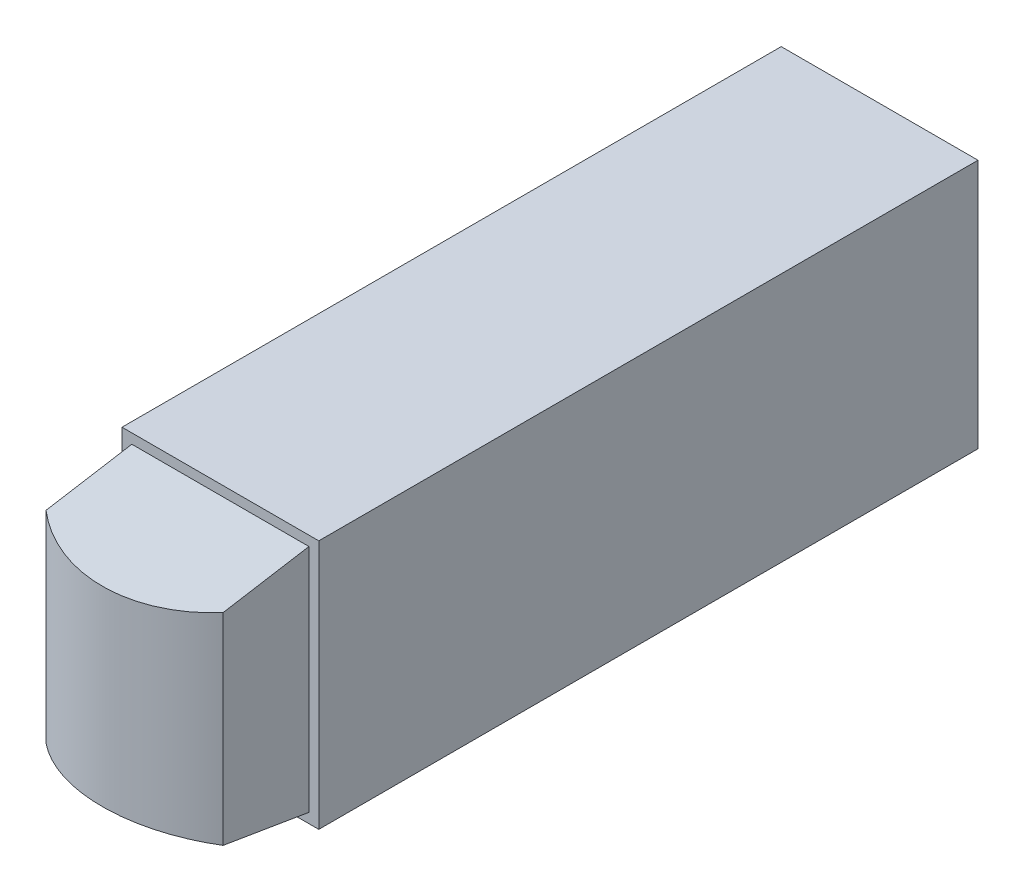
ISO-10303-21;
HEADER;
FILE_DESCRIPTION(('STEP AP214'),'2;1');
FILE_NAME('part.step','',(''),(''),'','','');
FILE_SCHEMA(('AUTOMOTIVE_DESIGN { 1 0 10303 214 1 1 1 1 }'));
ENDSEC;
DATA;
#1=APPLICATION_CONTEXT('core data for automotive mechanical design processes');
#2=APPLICATION_PROTOCOL_DEFINITION('international standard','automotive_design',2000,#1);
#3=PRODUCT_CONTEXT('',#1,'mechanical');
#4=PRODUCT('Part','Part','',(#3));
#5=PRODUCT_RELATED_PRODUCT_CATEGORY('part','',(#4));
#6=PRODUCT_DEFINITION_FORMATION('','',#4);
#7=PRODUCT_DEFINITION_CONTEXT('part definition',#1,'design');
#8=PRODUCT_DEFINITION('design','',#6,#7);
#9=PRODUCT_DEFINITION_SHAPE('','',#8);
#10=(LENGTH_UNIT() NAMED_UNIT(*) SI_UNIT(.MILLI.,.METRE.));
#11=(NAMED_UNIT(*) PLANE_ANGLE_UNIT() SI_UNIT($,.RADIAN.));
#12=(NAMED_UNIT(*) SI_UNIT($,.STERADIAN.) SOLID_ANGLE_UNIT());
#13=UNCERTAINTY_MEASURE_WITH_UNIT(LENGTH_MEASURE(1.E-05),#10,'distance_accuracy_value','');
#14=(GEOMETRIC_REPRESENTATION_CONTEXT(3) GLOBAL_UNCERTAINTY_ASSIGNED_CONTEXT((#13)) GLOBAL_UNIT_ASSIGNED_CONTEXT((#10,
#11,#12)) REPRESENTATION_CONTEXT('',''));
#15=CARTESIAN_POINT('',(0.,0.,0.));
#16=DIRECTION('',(0.,0.,1.));
#17=DIRECTION('',(1.,0.,0.));
#18=AXIS2_PLACEMENT_3D('',#15,#16,#17);
#19=CARTESIAN_POINT('',(0.,-0.635,3.25));
#20=DIRECTION('',(0.,-1.,0.));
#21=DIRECTION('',(0.,0.,-1.));
#22=AXIS2_PLACEMENT_3D('',#19,#20,#21);
#23=CYLINDRICAL_SURFACE('',#22,0.7);
#24=CARTESIAN_POINT('',(0.,-0.601666666666666,3.25));
#25=DIRECTION('',(0.,0.986393923832144,-0.164398987305357));
#26=DIRECTION('',(0.,-0.164398987305357,-0.986393923832144));
#27=AXIS2_PLACEMENT_3D('',#24,#25,#26);
#28=ELLIPSE('',#27,0.709655628534792,0.7);
#29=CARTESIAN_POINT('',(-0.45,-0.512301622543637,3.78619026473818));
#30=VERTEX_POINT('',#29);
#31=CARTESIAN_POINT('',(0.45,-0.512301622543637,3.78619026473818));
#32=VERTEX_POINT('',#31);
#33=EDGE_CURVE('E19',#30,#32,#28,.T.);
#34=ORIENTED_EDGE('',*,*,#33,.T.);
#35=DIRECTION('',(0.,1.,0.));
#36=VECTOR('',#35,1.);
#37=CARTESIAN_POINT('',(0.45,-0.635,3.78619026473818));
#38=LINE('',#37,#36);
#39=CARTESIAN_POINT('',(0.45,0.512301622543636,3.78619026473818));
#40=VERTEX_POINT('',#39);
#41=EDGE_CURVE('E81',#32,#40,#38,.T.);
#42=ORIENTED_EDGE('',*,*,#41,.T.);
#43=CARTESIAN_POINT('',(0.,0.601666666666667,3.25));
#44=DIRECTION('',(0.,0.986393923832144,0.164398987305358));
#45=DIRECTION('',(0.,-0.164398987305358,0.986393923832144));
#46=AXIS2_PLACEMENT_3D('',#43,#44,#45);
#47=ELLIPSE('',#46,0.709655628534792,0.7);
#48=CARTESIAN_POINT('',(-0.45,0.512301622543636,3.78619026473818));
#49=VERTEX_POINT('',#48);
#50=EDGE_CURVE('E110',#49,#40,#47,.T.);
#51=ORIENTED_EDGE('',*,*,#50,.F.);
#52=DIRECTION('',(0.,1.,0.));
#53=VECTOR('',#52,1.);
#54=CARTESIAN_POINT('',(-0.45,-0.635,3.78619026473818));
#55=LINE('',#54,#53);
#56=EDGE_CURVE('E78',#49,#30,#55,.F.);
#57=ORIENTED_EDGE('',*,*,#56,.T.);
#58=EDGE_LOOP('',(#34,#42,#51,#57));
#59=FACE_BOUND('',#58,.T.);
#60=ADVANCED_FACE('F16',(#59),#23,.T.);
#61=CARTESIAN_POINT('',(-0.45,-0.635,3.78619026473818));
#62=DIRECTION('',(1.,0.,0.));
#63=DIRECTION('',(0.,0.,-1.));
#64=AXIS2_PLACEMENT_3D('',#61,#62,#63);
#65=PLANE('',#64);
#66=DIRECTION('',(0.,1.,0.));
#67=VECTOR('',#66,1.);
#68=CARTESIAN_POINT('',(-0.45,-0.635,3.35));
#69=LINE('',#68,#67);
#70=CARTESIAN_POINT('',(-0.45,0.585,3.35));
#71=VERTEX_POINT('',#70);
#72=CARTESIAN_POINT('',(-0.45,-0.585,3.35));
#73=VERTEX_POINT('',#72);
#74=EDGE_CURVE('E108',#71,#73,#69,.F.);
#75=ORIENTED_EDGE('',*,*,#74,.T.);
#76=DIRECTION('',(0.,0.164398987305357,0.986393923832144));
#77=VECTOR('',#76,1.);
#78=CARTESIAN_POINT('',(-0.45,-0.485,3.95));
#79=LINE('',#78,#77);
#80=EDGE_CURVE('E87',#73,#30,#79,.T.);
#81=ORIENTED_EDGE('',*,*,#80,.T.);
#82=ORIENTED_EDGE('',*,*,#56,.F.);
#83=DIRECTION('',(0.,-0.164398987305358,0.986393923832144));
#84=VECTOR('',#83,1.);
#85=CARTESIAN_POINT('',(-0.45,0.585,3.35));
#86=LINE('',#85,#84);
#87=EDGE_CURVE('E112',#71,#49,#86,.T.);
#88=ORIENTED_EDGE('',*,*,#87,.F.);
#89=EDGE_LOOP('',(#75,#81,#82,#88));
#90=FACE_BOUND('',#89,.T.);
#91=ADVANCED_FACE('F246',(#90),#65,.F.);
#92=CARTESIAN_POINT('',(3.76795032773344,-0.485,3.95));
#93=DIRECTION('',(0.,0.986393923832144,-0.164398987305357));
#94=DIRECTION('',(0.,0.164398987305357,0.986393923832144));
#95=AXIS2_PLACEMENT_3D('',#92,#93,#94);
#96=PLANE('',#95);
#97=ORIENTED_EDGE('',*,*,#80,.F.);
#98=DIRECTION('',(-1.,0.,0.));
#99=VECTOR('',#98,1.);
#100=CARTESIAN_POINT('',(-0.45,-0.585,3.35));
#101=LINE('',#100,#99);
#102=CARTESIAN_POINT('',(0.45,-0.585,3.35));
#103=VERTEX_POINT('',#102);
#104=EDGE_CURVE('E98',#73,#103,#101,.F.);
#105=ORIENTED_EDGE('',*,*,#104,.T.);
#106=DIRECTION('',(0.,0.164398987305357,0.986393923832144));
#107=VECTOR('',#106,1.);
#108=CARTESIAN_POINT('',(0.45,-0.585,3.35));
#109=LINE('',#108,#107);
#110=EDGE_CURVE('E86',#103,#32,#109,.T.);
#111=ORIENTED_EDGE('',*,*,#110,.T.);
#112=ORIENTED_EDGE('',*,*,#33,.F.);
#113=EDGE_LOOP('',(#97,#105,#111,#112));
#114=FACE_BOUND('',#113,.T.);
#115=ADVANCED_FACE('F96',(#114),#96,.F.);
#116=CARTESIAN_POINT('',(0.45,-0.635,3.35));
#117=DIRECTION('',(-1.,0.,0.));
#118=DIRECTION('',(0.,0.,1.));
#119=AXIS2_PLACEMENT_3D('',#116,#117,#118);
#120=PLANE('',#119);
#121=ORIENTED_EDGE('',*,*,#41,.F.);
#122=ORIENTED_EDGE('',*,*,#110,.F.);
#123=DIRECTION('',(0.,1.,0.));
#124=VECTOR('',#123,1.);
#125=CARTESIAN_POINT('',(0.45,-0.635,3.35));
#126=LINE('',#125,#124);
#127=CARTESIAN_POINT('',(0.45,0.585,3.35));
#128=VERTEX_POINT('',#127);
#129=EDGE_CURVE('E107',#103,#128,#126,.T.);
#130=ORIENTED_EDGE('',*,*,#129,.T.);
#131=DIRECTION('',(0.,-0.164398987305358,0.986393923832144));
#132=VECTOR('',#131,1.);
#133=CARTESIAN_POINT('',(0.45,0.585,3.35));
#134=LINE('',#133,#132);
#135=EDGE_CURVE('E93',#40,#128,#134,.F.);
#136=ORIENTED_EDGE('',*,*,#135,.F.);
#137=EDGE_LOOP('',(#121,#122,#130,#136));
#138=FACE_BOUND('',#137,.T.);
#139=ADVANCED_FACE('F90',(#138),#120,.F.);
#140=CARTESIAN_POINT('',(3.76795032773344,0.585,3.35));
#141=DIRECTION('',(0.,0.986393923832144,0.164398987305358));
#142=DIRECTION('',(0.,-0.164398987305358,0.986393923832144));
#143=AXIS2_PLACEMENT_3D('',#140,#141,#142);
#144=PLANE('',#143);
#145=ORIENTED_EDGE('',*,*,#87,.T.);
#146=ORIENTED_EDGE('',*,*,#50,.T.);
#147=ORIENTED_EDGE('',*,*,#135,.T.);
#148=DIRECTION('',(-1.,0.,0.));
#149=VECTOR('',#148,1.);
#150=CARTESIAN_POINT('',(-0.45,0.585,3.35));
#151=LINE('',#150,#149);
#152=EDGE_CURVE('E134',#128,#71,#151,.T.);
#153=ORIENTED_EDGE('',*,*,#152,.T.);
#154=EDGE_LOOP('',(#145,#146,#147,#153));
#155=FACE_BOUND('',#154,.T.);
#156=ADVANCED_FACE('F142',(#155),#144,.T.);
#157=CARTESIAN_POINT('',(0.5,-0.635,0.));
#158=DIRECTION('',(-1.,0.,0.));
#159=DIRECTION('',(0.,0.,1.));
#160=AXIS2_PLACEMENT_3D('',#157,#158,#159);
#161=PLANE('',#160);
#162=DIRECTION('',(0.,1.,0.));
#163=VECTOR('',#162,1.);
#164=CARTESIAN_POINT('',(0.5,-0.635,3.35));
#165=LINE('',#164,#163);
#166=CARTESIAN_POINT('',(0.5,0.635,3.35));
#167=VERTEX_POINT('',#166);
#168=CARTESIAN_POINT('',(0.5,-0.635,3.35));
#169=VERTEX_POINT('',#168);
#170=EDGE_CURVE('E111',#167,#169,#165,.F.);
#171=ORIENTED_EDGE('',*,*,#170,.T.);
#172=DIRECTION('',(0.,0.,-1.));
#173=VECTOR('',#172,1.);
#174=CARTESIAN_POINT('',(0.5,-0.635,3.25));
#175=LINE('',#174,#173);
#176=CARTESIAN_POINT('',(0.5,-0.635,0.));
#177=VERTEX_POINT('',#176);
#178=EDGE_CURVE('E278',#177,#169,#175,.F.);
#179=ORIENTED_EDGE('',*,*,#178,.F.);
#180=DIRECTION('',(0.,1.,0.));
#181=VECTOR('',#180,1.);
#182=CARTESIAN_POINT('',(0.5,-0.635,0.));
#183=LINE('',#182,#181);
#184=CARTESIAN_POINT('',(0.5,0.635,0.));
#185=VERTEX_POINT('',#184);
#186=EDGE_CURVE('E284',#177,#185,#183,.T.);
#187=ORIENTED_EDGE('',*,*,#186,.T.);
#188=DIRECTION('',(0.,0.,-1.));
#189=VECTOR('',#188,1.);
#190=CARTESIAN_POINT('',(0.5,0.635,3.25));
#191=LINE('',#190,#189);
#192=EDGE_CURVE('E296',#185,#167,#191,.F.);
#193=ORIENTED_EDGE('',*,*,#192,.T.);
#194=EDGE_LOOP('',(#171,#179,#187,#193));
#195=FACE_BOUND('',#194,.T.);
#196=ADVANCED_FACE('F144',(#195),#161,.F.);
#197=CARTESIAN_POINT('',(-0.45,-0.635,3.35));
#198=DIRECTION('',(0.,0.,-1.));
#199=DIRECTION('',(-1.,0.,0.));
#200=AXIS2_PLACEMENT_3D('',#197,#198,#199);
#201=PLANE('',#200);
#202=ORIENTED_EDGE('',*,*,#129,.F.);
#203=ORIENTED_EDGE('',*,*,#104,.F.);
#204=ORIENTED_EDGE('',*,*,#74,.F.);
#205=ORIENTED_EDGE('',*,*,#152,.F.);
#206=EDGE_LOOP('',(#202,#203,#204,#205));
#207=FACE_BOUND('',#206,.T.);
#208=DIRECTION('',(1.,0.,0.));
#209=VECTOR('',#208,1.);
#210=CARTESIAN_POINT('',(0.,0.635,3.35));
#211=LINE('',#210,#209);
#212=CARTESIAN_POINT('',(-0.5,0.635,3.35));
#213=VERTEX_POINT('',#212);
#214=EDGE_CURVE('E294',#167,#213,#211,.F.);
#215=ORIENTED_EDGE('',*,*,#214,.T.);
#216=DIRECTION('',(0.,1.,0.));
#217=VECTOR('',#216,1.);
#218=CARTESIAN_POINT('',(-0.5,-0.635,3.35));
#219=LINE('',#218,#217);
#220=CARTESIAN_POINT('',(-0.5,-0.635,3.35));
#221=VERTEX_POINT('',#220);
#222=EDGE_CURVE('E290',#213,#221,#219,.F.);
#223=ORIENTED_EDGE('',*,*,#222,.T.);
#224=DIRECTION('',(1.,0.,0.));
#225=VECTOR('',#224,1.);
#226=CARTESIAN_POINT('',(0.,-0.635,3.35));
#227=LINE('',#226,#225);
#228=EDGE_CURVE('E136',#169,#221,#227,.F.);
#229=ORIENTED_EDGE('',*,*,#228,.F.);
#230=ORIENTED_EDGE('',*,*,#170,.F.);
#231=EDGE_LOOP('',(#215,#223,#229,#230));
#232=FACE_BOUND('',#231,.T.);
#233=ADVANCED_FACE('F140',(#207,#232),#201,.F.);
#234=CARTESIAN_POINT('',(0.,-0.635,3.25));
#235=DIRECTION('',(0.,-1.,0.));
#236=DIRECTION('',(0.,0.,-1.));
#237=AXIS2_PLACEMENT_3D('',#234,#235,#236);
#238=PLANE('',#237);
#239=DIRECTION('',(1.,0.,0.));
#240=VECTOR('',#239,1.);
#241=CARTESIAN_POINT('',(-0.5,-0.635,0.));
#242=LINE('',#241,#240);
#243=CARTESIAN_POINT('',(-0.5,-0.635,0.));
#244=VERTEX_POINT('',#243);
#245=EDGE_CURVE('E277',#244,#177,#242,.T.);
#246=ORIENTED_EDGE('',*,*,#245,.T.);
#247=ORIENTED_EDGE('',*,*,#178,.T.);
#248=ORIENTED_EDGE('',*,*,#228,.T.);
#249=DIRECTION('',(0.,0.,-1.));
#250=VECTOR('',#249,1.);
#251=CARTESIAN_POINT('',(-0.5,-0.635,3.35));
#252=LINE('',#251,#250);
#253=EDGE_CURVE('E281',#221,#244,#252,.T.);
#254=ORIENTED_EDGE('',*,*,#253,.T.);
#255=EDGE_LOOP('',(#246,#247,#248,#254));
#256=FACE_BOUND('',#255,.T.);
#257=ADVANCED_FACE('F168',(#256),#238,.T.);
#258=CARTESIAN_POINT('',(-0.5,-0.635,0.));
#259=DIRECTION('',(0.,0.,1.));
#260=DIRECTION('',(1.,0.,0.));
#261=AXIS2_PLACEMENT_3D('',#258,#259,#260);
#262=PLANE('',#261);
#263=ORIENTED_EDGE('',*,*,#186,.F.);
#264=ORIENTED_EDGE('',*,*,#245,.F.);
#265=DIRECTION('',(0.,1.,0.));
#266=VECTOR('',#265,1.);
#267=CARTESIAN_POINT('',(-0.5,-0.635,0.));
#268=LINE('',#267,#266);
#269=CARTESIAN_POINT('',(-0.5,0.635,0.));
#270=VERTEX_POINT('',#269);
#271=EDGE_CURVE('E25',#244,#270,#268,.T.);
#272=ORIENTED_EDGE('',*,*,#271,.T.);
#273=DIRECTION('',(1.,0.,0.));
#274=VECTOR('',#273,1.);
#275=CARTESIAN_POINT('',(0.,0.635,0.));
#276=LINE('',#275,#274);
#277=EDGE_CURVE('E33',#270,#185,#276,.T.);
#278=ORIENTED_EDGE('',*,*,#277,.T.);
#279=EDGE_LOOP('',(#263,#264,#272,#278));
#280=FACE_BOUND('',#279,.T.);
#281=ADVANCED_FACE('F162',(#280),#262,.F.);
#282=CARTESIAN_POINT('',(0.,0.635,3.25));
#283=DIRECTION('',(0.,-1.,0.));
#284=DIRECTION('',(0.,0.,-1.));
#285=AXIS2_PLACEMENT_3D('',#282,#283,#284);
#286=PLANE('',#285);
#287=ORIENTED_EDGE('',*,*,#192,.F.);
#288=ORIENTED_EDGE('',*,*,#277,.F.);
#289=DIRECTION('',(0.,0.,-1.));
#290=VECTOR('',#289,1.);
#291=CARTESIAN_POINT('',(-0.5,0.635,3.35));
#292=LINE('',#291,#290);
#293=EDGE_CURVE('E11',#270,#213,#292,.F.);
#294=ORIENTED_EDGE('',*,*,#293,.T.);
#295=ORIENTED_EDGE('',*,*,#214,.F.);
#296=EDGE_LOOP('',(#287,#288,#294,#295));
#297=FACE_BOUND('',#296,.T.);
#298=ADVANCED_FACE('F156',(#297),#286,.F.);
#299=CARTESIAN_POINT('',(-0.5,-0.635,3.35));
#300=DIRECTION('',(1.,0.,0.));
#301=DIRECTION('',(0.,0.,-1.));
#302=AXIS2_PLACEMENT_3D('',#299,#300,#301);
#303=PLANE('',#302);
#304=ORIENTED_EDGE('',*,*,#271,.F.);
#305=ORIENTED_EDGE('',*,*,#253,.F.);
#306=ORIENTED_EDGE('',*,*,#222,.F.);
#307=ORIENTED_EDGE('',*,*,#293,.F.);
#308=EDGE_LOOP('',(#304,#305,#306,#307));
#309=FACE_BOUND('',#308,.T.);
#310=ADVANCED_FACE('F154',(#309),#303,.F.);
#311=CLOSED_SHELL('',(#60,#91,#115,#139,#156,#196,#233,#257,#281,#298,#310));
#312=MANIFOLD_SOLID_BREP('B1',#311);
#313=ADVANCED_BREP_SHAPE_REPRESENTATION('',(#18,#312),#14);
#314=SHAPE_DEFINITION_REPRESENTATION(#9,#313);
ENDSEC;
END-ISO-10303-21;
